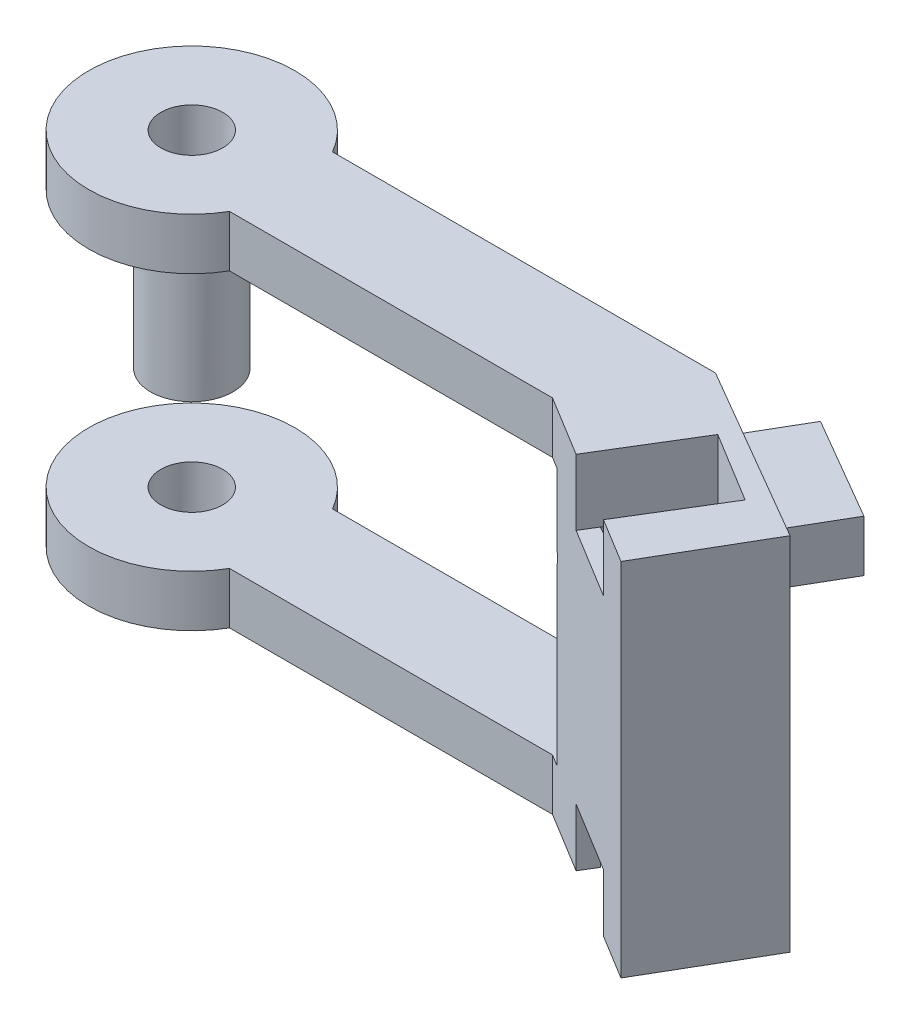
ISO-10303-21;
HEADER;
FILE_DESCRIPTION(('STEP AP214'),'2;1');
FILE_NAME('part.step','',(''),(''),'','','');
FILE_SCHEMA(('AUTOMOTIVE_DESIGN { 1 0 10303 214 1 1 1 1 }'));
ENDSEC;
DATA;
#1=APPLICATION_CONTEXT('core data for automotive mechanical design processes');
#2=APPLICATION_PROTOCOL_DEFINITION('international standard','automotive_design',2000,#1);
#3=PRODUCT_CONTEXT('',#1,'mechanical');
#4=PRODUCT('Part','Part','',(#3));
#5=PRODUCT_RELATED_PRODUCT_CATEGORY('part','',(#4));
#6=PRODUCT_DEFINITION_FORMATION('','',#4);
#7=PRODUCT_DEFINITION_CONTEXT('part definition',#1,'design');
#8=PRODUCT_DEFINITION('design','',#6,#7);
#9=PRODUCT_DEFINITION_SHAPE('','',#8);
#10=(LENGTH_UNIT() NAMED_UNIT(*) SI_UNIT(.MILLI.,.METRE.));
#11=(NAMED_UNIT(*) PLANE_ANGLE_UNIT() SI_UNIT($,.RADIAN.));
#12=(NAMED_UNIT(*) SI_UNIT($,.STERADIAN.) SOLID_ANGLE_UNIT());
#13=UNCERTAINTY_MEASURE_WITH_UNIT(LENGTH_MEASURE(1.E-05),#10,'distance_accuracy_value','');
#14=(GEOMETRIC_REPRESENTATION_CONTEXT(3) GLOBAL_UNCERTAINTY_ASSIGNED_CONTEXT((#13)) GLOBAL_UNIT_ASSIGNED_CONTEXT((#10,
#11,#12)) REPRESENTATION_CONTEXT('',''));
#15=CARTESIAN_POINT('',(0.,0.,0.));
#16=DIRECTION('',(0.,0.,1.));
#17=DIRECTION('',(1.,0.,0.));
#18=AXIS2_PLACEMENT_3D('',#15,#16,#17);
#19=CARTESIAN_POINT('',(-20.,35.,-5.));
#20=DIRECTION('',(0.,0.,1.));
#21=DIRECTION('',(1.,0.,0.));
#22=AXIS2_PLACEMENT_3D('',#19,#20,#21);
#23=PLANE('',#22);
#24=DIRECTION('',(0.,-1.,0.));
#25=VECTOR('',#24,1.);
#26=CARTESIAN_POINT('',(25.8151693115444,35.,-5.00000000000001));
#27=LINE('',#26,#25);
#28=CARTESIAN_POINT('',(25.8151693115444,70.,-5.00000000000001));
#29=VERTEX_POINT('',#28);
#30=CARTESIAN_POINT('',(25.8151693115444,35.,-5.00000000000001));
#31=VERTEX_POINT('',#30);
#32=EDGE_CURVE('E255',#29,#31,#27,.T.);
#33=ORIENTED_EDGE('',*,*,#32,.T.);
#34=DIRECTION('',(-1.,0.,0.));
#35=VECTOR('',#34,1.);
#36=CARTESIAN_POINT('',(-20.,35.,-5.));
#37=LINE('',#36,#35);
#38=CARTESIAN_POINT('',(-11.3397459621556,35.,-5.));
#39=VERTEX_POINT('',#38);
#40=EDGE_CURVE('E245',#31,#39,#37,.T.);
#41=ORIENTED_EDGE('',*,*,#40,.T.);
#42=DIRECTION('',(0.,1.,0.));
#43=VECTOR('',#42,1.);
#44=CARTESIAN_POINT('',(-11.3397459621556,30.,-5.));
#45=LINE('',#44,#43);
#46=CARTESIAN_POINT('',(-11.3397459621556,40.,-5.));
#47=VERTEX_POINT('',#46);
#48=EDGE_CURVE('E252',#39,#47,#45,.T.);
#49=ORIENTED_EDGE('',*,*,#48,.T.);
#50=DIRECTION('',(1.,0.,0.));
#51=VECTOR('',#50,1.);
#52=CARTESIAN_POINT('',(-27.1670170951595,40.,-5.));
#53=LINE('',#52,#51);
#54=CARTESIAN_POINT('',(21.0838329101293,40.,-5.00000000000001));
#55=VERTEX_POINT('',#54);
#56=EDGE_CURVE('E496',#47,#55,#53,.T.);
#57=ORIENTED_EDGE('',*,*,#56,.T.);
#58=DIRECTION('',(0.,1.,0.));
#59=VECTOR('',#58,1.);
#60=CARTESIAN_POINT('',(21.0838329101293,40.,-5.00000000000001));
#61=LINE('',#60,#59);
#62=CARTESIAN_POINT('',(21.0838329101293,65.,-5.00000000000001));
#63=VERTEX_POINT('',#62);
#64=EDGE_CURVE('E494',#55,#63,#61,.T.);
#65=ORIENTED_EDGE('',*,*,#64,.T.);
#66=DIRECTION('',(-1.,0.,0.));
#67=VECTOR('',#66,1.);
#68=CARTESIAN_POINT('',(-27.1670170951595,65.,-5.));
#69=LINE('',#68,#67);
#70=CARTESIAN_POINT('',(-11.3397459621556,65.,-5.));
#71=VERTEX_POINT('',#70);
#72=EDGE_CURVE('E373',#63,#71,#69,.T.);
#73=ORIENTED_EDGE('',*,*,#72,.T.);
#74=DIRECTION('',(0.,1.,0.));
#75=VECTOR('',#74,1.);
#76=CARTESIAN_POINT('',(-11.3397459621556,65.,-5.));
#77=LINE('',#76,#75);
#78=CARTESIAN_POINT('',(-11.3397459621556,70.,-5.00000000000001));
#79=VERTEX_POINT('',#78);
#80=EDGE_CURVE('E370',#79,#71,#77,.F.);
#81=ORIENTED_EDGE('',*,*,#80,.F.);
#82=DIRECTION('',(-1.,0.,0.));
#83=VECTOR('',#82,1.);
#84=CARTESIAN_POINT('',(20.,70.,-5.00000000000001));
#85=LINE('',#84,#83);
#86=EDGE_CURVE('E328',#29,#79,#85,.T.);
#87=ORIENTED_EDGE('',*,*,#86,.F.);
#88=EDGE_LOOP('',(#33,#41,#49,#57,#65,#73,#81,#87));
#89=FACE_BOUND('',#88,.T.);
#90=ADVANCED_FACE('F37',(#89),#23,.F.);
#91=CARTESIAN_POINT('',(-20.,35.,5.));
#92=DIRECTION('',(0.,0.,-1.));
#93=DIRECTION('',(-1.,0.,0.));
#94=AXIS2_PLACEMENT_3D('',#91,#92,#93);
#95=PLANE('',#94);
#96=DIRECTION('',(0.,1.,0.));
#97=VECTOR('',#96,1.);
#98=CARTESIAN_POINT('',(-11.3397459621556,65.,5.));
#99=LINE('',#98,#97);
#100=CARTESIAN_POINT('',(-11.3397459621556,65.,5.));
#101=VERTEX_POINT('',#100);
#102=CARTESIAN_POINT('',(-11.3397459621556,70.,5.));
#103=VERTEX_POINT('',#102);
#104=EDGE_CURVE('E376',#101,#103,#99,.T.);
#105=ORIENTED_EDGE('',*,*,#104,.F.);
#106=DIRECTION('',(-1.,0.,0.));
#107=VECTOR('',#106,1.);
#108=CARTESIAN_POINT('',(-20.,65.,5.));
#109=LINE('',#108,#107);
#110=CARTESIAN_POINT('',(20.,65.,4.99999999999999));
#111=VERTEX_POINT('',#110);
#112=EDGE_CURVE('E502',#111,#101,#109,.T.);
#113=ORIENTED_EDGE('',*,*,#112,.F.);
#114=DIRECTION('',(0.,-1.,0.));
#115=VECTOR('',#114,1.);
#116=CARTESIAN_POINT('',(20.,35.,4.99999999999999));
#117=LINE('',#116,#115);
#118=CARTESIAN_POINT('',(20.,70.,4.99999999999999));
#119=VERTEX_POINT('',#118);
#120=EDGE_CURVE('E296',#119,#111,#117,.T.);
#121=ORIENTED_EDGE('',*,*,#120,.F.);
#122=DIRECTION('',(1.,0.,0.));
#123=VECTOR('',#122,1.);
#124=CARTESIAN_POINT('',(-20.,70.,5.));
#125=LINE('',#124,#123);
#126=EDGE_CURVE('E263',#103,#119,#125,.T.);
#127=ORIENTED_EDGE('',*,*,#126,.F.);
#128=EDGE_LOOP('',(#105,#113,#121,#127));
#129=FACE_BOUND('',#128,.T.);
#130=ADVANCED_FACE('F548',(#129),#95,.F.);
#131=CARTESIAN_POINT('',(-20.,0.,0.));
#132=DIRECTION('',(0.,1.,0.));
#133=DIRECTION('',(0.,0.,1.));
#134=AXIS2_PLACEMENT_3D('',#131,#132,#133);
#135=CYLINDRICAL_SURFACE('',#134,3.);
#136=CARTESIAN_POINT('',(-20.,50.,0.));
#137=DIRECTION('',(0.,1.,0.));
#138=DIRECTION('',(-1.,0.,0.));
#139=AXIS2_PLACEMENT_3D('',#136,#137,#138);
#140=CIRCLE('',#139,3.);
#141=CARTESIAN_POINT('',(-23.,50.,0.));
#142=VERTEX_POINT('',#141);
#143=EDGE_CURVE('E463',#142,#142,#140,.F.);
#144=ORIENTED_EDGE('',*,*,#143,.T.);
#145=EDGE_LOOP('',(#144));
#146=FACE_BOUND('',#145,.T.);
#147=CARTESIAN_POINT('',(-20.,70.,0.));
#148=DIRECTION('',(0.,1.,0.));
#149=DIRECTION('',(0.,0.,1.));
#150=AXIS2_PLACEMENT_3D('',#147,#148,#149);
#151=CIRCLE('',#150,3.);
#152=CARTESIAN_POINT('',(-20.,70.,3.));
#153=VERTEX_POINT('',#152);
#154=EDGE_CURVE('E538',#153,#153,#151,.T.);
#155=ORIENTED_EDGE('',*,*,#154,.T.);
#156=EDGE_LOOP('',(#155));
#157=FACE_BOUND('',#156,.T.);
#158=ADVANCED_FACE('F571',(#146,#157),#135,.F.);
#159=DIRECTION('',(0.,1.,0.));
#160=VECTOR('',#159,1.);
#161=CARTESIAN_POINT('',(-11.3397459621556,30.,5.));
#162=LINE('',#161,#160);
#163=CARTESIAN_POINT('',(-11.3397459621556,40.,5.));
#164=VERTEX_POINT('',#163);
#165=CARTESIAN_POINT('',(-11.3397459621556,35.,5.));
#166=VERTEX_POINT('',#165);
#167=EDGE_CURVE('E262',#164,#166,#162,.F.);
#168=ORIENTED_EDGE('',*,*,#167,.T.);
#169=DIRECTION('',(1.,0.,0.));
#170=VECTOR('',#169,1.);
#171=CARTESIAN_POINT('',(-20.,35.,5.));
#172=LINE('',#171,#170);
#173=CARTESIAN_POINT('',(20.,35.,4.99999999999999));
#174=VERTEX_POINT('',#173);
#175=EDGE_CURVE('E59',#166,#174,#172,.T.);
#176=ORIENTED_EDGE('',*,*,#175,.T.);
#177=CARTESIAN_POINT('',(20.,40.,4.99999999999999));
#178=VERTEX_POINT('',#177);
#179=EDGE_CURVE('E295',#178,#174,#117,.T.);
#180=ORIENTED_EDGE('',*,*,#179,.F.);
#181=DIRECTION('',(1.,0.,0.));
#182=VECTOR('',#181,1.);
#183=CARTESIAN_POINT('',(-20.,40.,5.));
#184=LINE('',#183,#182);
#185=EDGE_CURVE('E329',#164,#178,#184,.T.);
#186=ORIENTED_EDGE('',*,*,#185,.F.);
#187=EDGE_LOOP('',(#168,#176,#180,#186));
#188=FACE_BOUND('',#187,.T.);
#189=ADVANCED_FACE('F39',(#188),#95,.F.);
#190=CARTESIAN_POINT('',(25.4009398541464,40.6,6.32701353081305));
#191=DIRECTION('',(0.,1.,0.));
#192=DIRECTION('',(0.,0.,1.));
#193=AXIS2_PLACEMENT_3D('',#190,#191,#192);
#194=PLANE('',#193);
#195=DIRECTION('',(0.864461513763628,0.,0.502699006584951));
#196=VECTOR('',#195,1.);
#197=CARTESIAN_POINT('',(25.4009398541464,40.6,6.32701353081305));
#198=LINE('',#197,#196);
#199=CARTESIAN_POINT('',(25.4009398541464,40.6,6.32701353081305));
#200=VERTEX_POINT('',#199);
#201=CARTESIAN_POINT('',(25.5306090812109,40.6,6.40241838180079));
#202=VERTEX_POINT('',#201);
#203=EDGE_CURVE('E470',#200,#202,#198,.T.);
#204=ORIENTED_EDGE('',*,*,#203,.T.);
#205=DIRECTION('',(0.50269900658495,0.,-0.864461513763629));
#206=VECTOR('',#205,1.);
#207=CARTESIAN_POINT('',(25.5306090812109,40.6,6.40241838180079));
#208=LINE('',#207,#206);
#209=CARTESIAN_POINT('',(30.5575991470604,40.6,-2.24219675583549));
#210=VERTEX_POINT('',#209);
#211=EDGE_CURVE('E389',#202,#210,#208,.T.);
#212=ORIENTED_EDGE('',*,*,#211,.T.);
#213=DIRECTION('',(0.864461513763628,0.,0.502699006584951));
#214=VECTOR('',#213,1.);
#215=CARTESIAN_POINT('',(30.4279299199959,40.6,-2.31760160682324));
#216=LINE('',#215,#214);
#217=CARTESIAN_POINT('',(30.4279299199959,40.6,-2.31760160682324));
#218=VERTEX_POINT('',#217);
#219=EDGE_CURVE('E469',#218,#210,#216,.T.);
#220=ORIENTED_EDGE('',*,*,#219,.F.);
#221=DIRECTION('',(0.50269900658495,0.,-0.864461513763628));
#222=VECTOR('',#221,1.);
#223=CARTESIAN_POINT('',(25.4009398541464,40.6,6.32701353081305));
#224=LINE('',#223,#222);
#225=EDGE_CURVE('E480',#200,#218,#224,.T.);
#226=ORIENTED_EDGE('',*,*,#225,.F.);
#227=EDGE_LOOP('',(#204,#212,#220,#226));
#228=FACE_BOUND('',#227,.T.);
#229=ADVANCED_FACE('F579',(#228),#194,.T.);
#230=CARTESIAN_POINT('',(25.8151693115444,35.,-5.00000000000001));
#231=DIRECTION('',(-0.50269900658495,0.,0.864461513763628));
#232=DIRECTION('',(0.864461513763629,0.,0.502699006584951));
#233=AXIS2_PLACEMENT_3D('',#230,#231,#232);
#234=PLANE('',#233);
#235=DIRECTION('',(0.,-1.,0.));
#236=VECTOR('',#235,1.);
#237=CARTESIAN_POINT('',(43.104399586817,35.,5.05398013169901));
#238=LINE('',#237,#236);
#239=CARTESIAN_POINT('',(43.104399586817,70.,5.05398013169901));
#240=VERTEX_POINT('',#239);
#241=CARTESIAN_POINT('',(43.104399586817,35.,5.05398013169901));
#242=VERTEX_POINT('',#241);
#243=EDGE_CURVE('E289',#240,#242,#238,.T.);
#244=ORIENTED_EDGE('',*,*,#243,.T.);
#245=DIRECTION('',(-0.864461513763629,0.,-0.502699006584951));
#246=VECTOR('',#245,1.);
#247=CARTESIAN_POINT('',(25.8151693115444,35.,-5.00000000000001));
#248=LINE('',#247,#246);
#249=CARTESIAN_POINT('',(40.943245802408,35.,3.79723261523664));
#250=VERTEX_POINT('',#249);
#251=EDGE_CURVE('E523',#242,#250,#248,.T.);
#252=ORIENTED_EDGE('',*,*,#251,.T.);
#253=DIRECTION('',(0.,1.,0.));
#254=VECTOR('',#253,1.);
#255=CARTESIAN_POINT('',(40.943245802408,35.,3.79723261523664));
#256=LINE('',#255,#254);
#257=CARTESIAN_POINT('',(40.943245802408,63.6,3.79723261523664));
#258=VERTEX_POINT('',#257);
#259=EDGE_CURVE('E280',#250,#258,#256,.T.);
#260=ORIENTED_EDGE('',*,*,#259,.T.);
#261=DIRECTION('',(0.864461513763629,0.,0.502699006584951));
#262=VECTOR('',#261,1.);
#263=CARTESIAN_POINT('',(25.8151693115444,63.6,-5.00000000000001));
#264=LINE('',#263,#262);
#265=CARTESIAN_POINT('',(40.6285757824067,63.6,3.61424667087918));
#266=VERTEX_POINT('',#265);
#267=EDGE_CURVE('E386',#266,#258,#264,.T.);
#268=ORIENTED_EDGE('',*,*,#267,.F.);
#269=DIRECTION('',(0.,1.,0.));
#270=VECTOR('',#269,1.);
#271=CARTESIAN_POINT('',(40.6285757824067,63.6,3.61424667087918));
#272=LINE('',#271,#270);
#273=CARTESIAN_POINT('',(40.6285757824067,68.6,3.61424667087918));
#274=VERTEX_POINT('',#273);
#275=EDGE_CURVE('E430',#266,#274,#272,.T.);
#276=ORIENTED_EDGE('',*,*,#275,.T.);
#277=DIRECTION('',(-0.864461513763628,0.,-0.50269900658495));
#278=VECTOR('',#277,1.);
#279=CARTESIAN_POINT('',(40.6285757824067,68.6,3.61424667087918));
#280=LINE('',#279,#278);
#281=CARTESIAN_POINT('',(30.5575991470604,68.6,-2.24219675583549));
#282=VERTEX_POINT('',#281);
#283=EDGE_CURVE('E437',#274,#282,#280,.T.);
#284=ORIENTED_EDGE('',*,*,#283,.T.);
#285=DIRECTION('',(0.,-1.,0.));
#286=VECTOR('',#285,1.);
#287=CARTESIAN_POINT('',(30.5575991470604,63.6,-2.24219675583549));
#288=LINE('',#287,#286);
#289=CARTESIAN_POINT('',(30.5575991470604,63.6,-2.24219675583549));
#290=VERTEX_POINT('',#289);
#291=EDGE_CURVE('E448',#282,#290,#288,.T.);
#292=ORIENTED_EDGE('',*,*,#291,.T.);
#293=DIRECTION('',(-0.864461513763628,0.,-0.50269900658495));
#294=VECTOR('',#293,1.);
#295=CARTESIAN_POINT('',(30.4279299199959,63.6,-2.31760160682324));
#296=LINE('',#295,#294);
#297=CARTESIAN_POINT('',(30.4279299199959,63.6,-2.31760160682324));
#298=VERTEX_POINT('',#297);
#299=EDGE_CURVE('E487',#290,#298,#296,.T.);
#300=ORIENTED_EDGE('',*,*,#299,.T.);
#301=DIRECTION('',(0.,-1.,0.));
#302=VECTOR('',#301,1.);
#303=CARTESIAN_POINT('',(30.4279299199959,40.6,-2.31760160682324));
#304=LINE('',#303,#302);
#305=EDGE_CURVE('E484',#298,#218,#304,.T.);
#306=ORIENTED_EDGE('',*,*,#305,.T.);
#307=ORIENTED_EDGE('',*,*,#219,.T.);
#308=DIRECTION('',(0.,1.,0.));
#309=VECTOR('',#308,1.);
#310=CARTESIAN_POINT('',(30.5575991470604,29.4,-2.24219675583549));
#311=LINE('',#310,#309);
#312=CARTESIAN_POINT('',(30.5575991470604,35.,-2.24219675583549));
#313=VERTEX_POINT('',#312);
#314=EDGE_CURVE('E285',#313,#210,#311,.T.);
#315=ORIENTED_EDGE('',*,*,#314,.F.);
#316=EDGE_CURVE('E520',#313,#31,#248,.T.);
#317=ORIENTED_EDGE('',*,*,#316,.T.);
#318=ORIENTED_EDGE('',*,*,#32,.F.);
#319=DIRECTION('',(-0.864461513763628,0.,-0.502699006584951));
#320=VECTOR('',#319,1.);
#321=CARTESIAN_POINT('',(25.8151693115444,70.,-5.00000000000001));
#322=LINE('',#321,#320);
#323=EDGE_CURVE('E335',#240,#29,#322,.T.);
#324=ORIENTED_EDGE('',*,*,#323,.F.);
#325=EDGE_LOOP('',(#244,#252,#260,#268,#276,#284,#292,#300,#306,#307,#315,#317,#318,#324));
#326=FACE_BOUND('',#325,.T.);
#327=ADVANCED_FACE('F364',(#326),#234,.F.);
#328=CARTESIAN_POINT('',(25.8822809888346,11.8971644156994,8.59291472879151));
#329=DIRECTION('',(-0.85339881586406,0.,-0.52125853574001));
#330=DIRECTION('',(-0.52125853574001,0.,0.85339881586406));
#331=AXIS2_PLACEMENT_3D('',#328,#329,#330);
#332=PLANE('',#331);
#333=DIRECTION('',(0.,1.,0.));
#334=VECTOR('',#333,1.);
#335=CARTESIAN_POINT('',(25.8822809888346,11.8971644156994,8.59291472879151));
#336=LINE('',#335,#334);
#337=CARTESIAN_POINT('',(25.8822809888346,35.,8.59291472879151));
#338=VERTEX_POINT('',#337);
#339=CARTESIAN_POINT('',(25.8822809888346,40.6,8.59291472879151));
#340=VERTEX_POINT('',#339);
#341=EDGE_CURVE('E283',#338,#340,#336,.T.);
#342=ORIENTED_EDGE('',*,*,#341,.F.);
#343=DIRECTION('',(0.52125853574001,0.,-0.85339881586406));
#344=VECTOR('',#343,1.);
#345=CARTESIAN_POINT('',(25.8822809888346,35.,8.59291472879151));
#346=LINE('',#345,#344);
#347=CARTESIAN_POINT('',(26.7773942266134,35.,7.12744505336418));
#348=VERTEX_POINT('',#347);
#349=EDGE_CURVE('E517',#338,#348,#346,.T.);
#350=ORIENTED_EDGE('',*,*,#349,.T.);
#351=DIRECTION('',(0.,-1.,0.));
#352=VECTOR('',#351,1.);
#353=CARTESIAN_POINT('',(26.7773942266134,11.8971644156994,7.12744505336418));
#354=LINE('',#353,#352);
#355=CARTESIAN_POINT('',(26.7773942266134,40.6,7.12744505336418));
#356=VERTEX_POINT('',#355);
#357=EDGE_CURVE('E277',#356,#348,#354,.T.);
#358=ORIENTED_EDGE('',*,*,#357,.F.);
#359=DIRECTION('',(0.52125853574001,0.,-0.85339881586406));
#360=VECTOR('',#359,1.);
#361=CARTESIAN_POINT('',(25.8822809888346,40.6,8.59291472879151));
#362=LINE('',#361,#360);
#363=EDGE_CURVE('E406',#340,#356,#362,.T.);
#364=ORIENTED_EDGE('',*,*,#363,.F.);
#365=EDGE_LOOP('',(#342,#350,#358,#364));
#366=FACE_BOUND('',#365,.T.);
#367=ADVANCED_FACE('F578',(#366),#332,.F.);
#368=CARTESIAN_POINT('',(37.9220568731472,11.8971644156994,4.228994856071));
#369=DIRECTION('',(0.85339881586406,0.,0.521258535740011));
#370=DIRECTION('',(0.521258535740011,0.,-0.85339881586406));
#371=AXIS2_PLACEMENT_3D('',#368,#369,#370);
#372=PLANE('',#371);
#373=DIRECTION('',(0.,1.,0.));
#374=VECTOR('',#373,1.);
#375=CARTESIAN_POINT('',(33.694700972413,11.8971644156994,11.1499760440355));
#376=LINE('',#375,#374);
#377=CARTESIAN_POINT('',(33.694700972413,35.,11.1499760440355));
#378=VERTEX_POINT('',#377);
#379=CARTESIAN_POINT('',(33.694700972413,40.6,11.1499760440355));
#380=VERTEX_POINT('',#379);
#381=EDGE_CURVE('E275',#378,#380,#376,.T.);
#382=ORIENTED_EDGE('',*,*,#381,.F.);
#383=DIRECTION('',(-0.521258535740011,0.,0.85339881586406));
#384=VECTOR('',#383,1.);
#385=CARTESIAN_POINT('',(37.9220568731472,35.,4.228994856071));
#386=LINE('',#385,#384);
#387=CARTESIAN_POINT('',(32.7094715157471,35.,12.7629830147116));
#388=VERTEX_POINT('',#387);
#389=EDGE_CURVE('E531',#378,#388,#386,.T.);
#390=ORIENTED_EDGE('',*,*,#389,.T.);
#391=DIRECTION('',(0.,1.,0.));
#392=VECTOR('',#391,1.);
#393=CARTESIAN_POINT('',(32.7094715157471,11.8971644156994,12.7629830147116));
#394=LINE('',#393,#392);
#395=CARTESIAN_POINT('',(32.7094715157471,40.6,12.7629830147116));
#396=VERTEX_POINT('',#395);
#397=EDGE_CURVE('E282',#388,#396,#394,.T.);
#398=ORIENTED_EDGE('',*,*,#397,.T.);
#399=DIRECTION('',(-0.521258535740011,0.,0.85339881586406));
#400=VECTOR('',#399,1.);
#401=CARTESIAN_POINT('',(37.9220568731472,40.6,4.228994856071));
#402=LINE('',#401,#400);
#403=EDGE_CURVE('E424',#380,#396,#402,.T.);
#404=ORIENTED_EDGE('',*,*,#403,.F.);
#405=EDGE_LOOP('',(#382,#390,#398,#404));
#406=FACE_BOUND('',#405,.T.);
#407=ADVANCED_FACE('F590',(#406),#372,.F.);
#408=CARTESIAN_POINT('',(21.0838329101293,40.,25.));
#409=DIRECTION('',(-1.,0.,0.));
#410=DIRECTION('',(0.,0.,1.));
#411=AXIS2_PLACEMENT_3D('',#408,#409,#410);
#412=PLANE('',#411);
#413=DIRECTION('',(0.,-1.,0.));
#414=VECTOR('',#413,1.);
#415=CARTESIAN_POINT('',(21.0838329101293,40.,4.99999999999999));
#416=LINE('',#415,#414);
#417=CARTESIAN_POINT('',(21.0838329101293,58.1618485481595,4.99999999999999));
#418=VERTEX_POINT('',#417);
#419=CARTESIAN_POINT('',(21.0838329101293,56.8381514518405,4.99999999999999));
#420=VERTEX_POINT('',#419);
#421=EDGE_CURVE('E302',#418,#420,#416,.T.);
#422=ORIENTED_EDGE('',*,*,#421,.F.);
#423=DIRECTION('',(0.,0.,-1.));
#424=VECTOR('',#423,1.);
#425=CARTESIAN_POINT('',(21.0838329101293,58.1618485481595,105.));
#426=LINE('',#425,#424);
#427=CARTESIAN_POINT('',(21.0838329101293,58.1618485481595,5.66200836609879));
#428=VERTEX_POINT('',#427);
#429=EDGE_CURVE('E45',#418,#428,#426,.F.);
#430=ORIENTED_EDGE('',*,*,#429,.T.);
#431=DIRECTION('',(0.,1.,0.));
#432=VECTOR('',#431,1.);
#433=CARTESIAN_POINT('',(21.0838329101293,35.,5.66200836609879));
#434=LINE('',#433,#432);
#435=CARTESIAN_POINT('',(21.0838329101293,65.,5.66200836609879));
#436=VERTEX_POINT('',#435);
#437=EDGE_CURVE('E312',#428,#436,#434,.T.);
#438=ORIENTED_EDGE('',*,*,#437,.T.);
#439=DIRECTION('',(0.,0.,-1.));
#440=VECTOR('',#439,1.);
#441=CARTESIAN_POINT('',(21.0838329101293,65.,25.));
#442=LINE('',#441,#440);
#443=EDGE_CURVE('E498',#436,#63,#442,.T.);
#444=ORIENTED_EDGE('',*,*,#443,.T.);
#445=ORIENTED_EDGE('',*,*,#64,.F.);
#446=DIRECTION('',(0.,0.,-1.));
#447=VECTOR('',#446,1.);
#448=CARTESIAN_POINT('',(21.0838329101293,40.,25.));
#449=LINE('',#448,#447);
#450=CARTESIAN_POINT('',(21.0838329101293,40.,5.66200836609879));
#451=VERTEX_POINT('',#450);
#452=EDGE_CURVE('E499',#451,#55,#449,.T.);
#453=ORIENTED_EDGE('',*,*,#452,.F.);
#454=CARTESIAN_POINT('',(21.0838329101293,56.8381514518405,5.66200836609879));
#455=VERTEX_POINT('',#454);
#456=EDGE_CURVE('E325',#451,#455,#434,.T.);
#457=ORIENTED_EDGE('',*,*,#456,.T.);
#458=DIRECTION('',(0.,0.,-1.));
#459=VECTOR('',#458,1.);
#460=CARTESIAN_POINT('',(21.0838329101293,56.8381514518405,105.));
#461=LINE('',#460,#459);
#462=EDGE_CURVE('E304',#455,#420,#461,.T.);
#463=ORIENTED_EDGE('',*,*,#462,.T.);
#464=EDGE_LOOP('',(#422,#430,#438,#444,#445,#453,#457,#463));
#465=FACE_BOUND('',#464,.T.);
#466=ADVANCED_FACE('F311',(#465),#412,.T.);
#467=CARTESIAN_POINT('',(20.,35.,4.99999999999999));
#468=DIRECTION('',(0.52125853574001,0.,-0.85339881586406));
#469=DIRECTION('',(-0.85339881586406,0.,-0.52125853574001));
#470=AXIS2_PLACEMENT_3D('',#467,#468,#469);
#471=PLANE('',#470);
#472=ORIENTED_EDGE('',*,*,#179,.T.);
#473=DIRECTION('',(0.85339881586406,0.,0.52125853574001));
#474=VECTOR('',#473,1.);
#475=CARTESIAN_POINT('',(20.,35.,4.99999999999999));
#476=LINE('',#475,#474);
#477=EDGE_CURVE('E256',#174,#338,#476,.T.);
#478=ORIENTED_EDGE('',*,*,#477,.T.);
#479=ORIENTED_EDGE('',*,*,#341,.T.);
#480=DIRECTION('',(-0.853398815864061,0.,-0.52125853574001));
#481=VECTOR('',#480,1.);
#482=CARTESIAN_POINT('',(32.7094715157471,40.6,12.7629830147116));
#483=LINE('',#482,#481);
#484=EDGE_CURVE('E427',#396,#340,#483,.T.);
#485=ORIENTED_EDGE('',*,*,#484,.F.);
#486=ORIENTED_EDGE('',*,*,#397,.F.);
#487=CARTESIAN_POINT('',(37.0679763172812,35.,15.4251707148002));
#488=VERTEX_POINT('',#487);
#489=EDGE_CURVE('E356',#388,#488,#476,.T.);
#490=ORIENTED_EDGE('',*,*,#489,.T.);
#491=DIRECTION('',(0.,-1.,0.));
#492=VECTOR('',#491,1.);
#493=CARTESIAN_POINT('',(37.0679763172812,35.,15.4251707148002));
#494=LINE('',#493,#492);
#495=CARTESIAN_POINT('',(37.0679763172812,70.,15.4251707148002));
#496=VERTEX_POINT('',#495);
#497=EDGE_CURVE('E292',#496,#488,#494,.T.);
#498=ORIENTED_EDGE('',*,*,#497,.F.);
#499=DIRECTION('',(0.85339881586406,0.,0.52125853574001));
#500=VECTOR('',#499,1.);
#501=CARTESIAN_POINT('',(20.,70.,4.99999999999999));
#502=LINE('',#501,#500);
#503=CARTESIAN_POINT('',(32.7094715157471,70.,12.7629830147116));
#504=VERTEX_POINT('',#503);
#505=EDGE_CURVE('E340',#504,#496,#502,.T.);
#506=ORIENTED_EDGE('',*,*,#505,.F.);
#507=DIRECTION('',(0.,1.,0.));
#508=VECTOR('',#507,1.);
#509=CARTESIAN_POINT('',(32.7094715157471,-11.1028355843006,12.7629830147116));
#510=LINE('',#509,#508);
#511=CARTESIAN_POINT('',(32.7094715157471,63.6,12.7629830147116));
#512=VERTEX_POINT('',#511);
#513=EDGE_CURVE('E412',#512,#504,#510,.T.);
#514=ORIENTED_EDGE('',*,*,#513,.F.);
#515=DIRECTION('',(0.85339881586406,0.,0.52125853574001));
#516=VECTOR('',#515,1.);
#517=CARTESIAN_POINT('',(25.8822809888346,63.6,8.59291472879151));
#518=LINE('',#517,#516);
#519=CARTESIAN_POINT('',(25.8822809888346,63.6,8.59291472879151));
#520=VERTEX_POINT('',#519);
#521=EDGE_CURVE('E403',#520,#512,#518,.T.);
#522=ORIENTED_EDGE('',*,*,#521,.F.);
#523=DIRECTION('',(0.,1.,0.));
#524=VECTOR('',#523,1.);
#525=CARTESIAN_POINT('',(25.8822809888346,-11.1028355843006,8.59291472879151));
#526=LINE('',#525,#524);
#527=CARTESIAN_POINT('',(25.8822809888346,70.,8.59291472879151));
#528=VERTEX_POINT('',#527);
#529=EDGE_CURVE('E413',#520,#528,#526,.T.);
#530=ORIENTED_EDGE('',*,*,#529,.T.);
#531=EDGE_CURVE('E267',#119,#528,#502,.T.);
#532=ORIENTED_EDGE('',*,*,#531,.F.);
#533=ORIENTED_EDGE('',*,*,#120,.T.);
#534=DIRECTION('',(-0.85339881586406,0.,-0.52125853574001));
#535=VECTOR('',#534,1.);
#536=CARTESIAN_POINT('',(20.,65.,4.99999999999999));
#537=LINE('',#536,#535);
#538=EDGE_CURVE('E324',#436,#111,#537,.T.);
#539=ORIENTED_EDGE('',*,*,#538,.F.);
#540=ORIENTED_EDGE('',*,*,#437,.F.);
#541=CARTESIAN_POINT('',(20.0187167196133,57.5,5.01143222802532));
#542=DIRECTION('',(0.52125853574001,0.,-0.85339881586406));
#543=DIRECTION('',(-0.85339881586406,0.,-0.52125853574001));
#544=AXIS2_PLACEMENT_3D('',#541,#542,#543);
#545=ELLIPSE('',#544,1.46941849073265,1.254);
#546=EDGE_CURVE('E322',#455,#428,#545,.F.);
#547=ORIENTED_EDGE('',*,*,#546,.F.);
#548=ORIENTED_EDGE('',*,*,#456,.F.);
#549=DIRECTION('',(0.85339881586406,0.,0.52125853574001));
#550=VECTOR('',#549,1.);
#551=CARTESIAN_POINT('',(20.,40.,4.99999999999999));
#552=LINE('',#551,#550);
#553=EDGE_CURVE('E326',#178,#451,#552,.T.);
#554=ORIENTED_EDGE('',*,*,#553,.F.);
#555=EDGE_LOOP('',(#472,#478,#479,#485,#486,#490,#498,#506,#514,#522,#530,#532,#533,#539,#540,
#547,#548,#554));
#556=FACE_BOUND('',#555,.T.);
#557=ADVANCED_FACE('F320',(#556),#471,.F.);
#558=CARTESIAN_POINT('',(-20.,70.,0.));
#559=DIRECTION('',(0.,-1.,0.));
#560=DIRECTION('',(0.,0.,1.));
#561=AXIS2_PLACEMENT_3D('',#558,#559,#560);
#562=PLANE('',#561);
#563=ORIENTED_EDGE('',*,*,#154,.F.);
#564=EDGE_LOOP('',(#563));
#565=FACE_BOUND('',#564,.T.);
#566=ORIENTED_EDGE('',*,*,#86,.T.);
#567=CARTESIAN_POINT('',(-20.,70.,0.));
#568=DIRECTION('',(0.,-1.,0.));
#569=DIRECTION('',(0.,0.,-1.));
#570=AXIS2_PLACEMENT_3D('',#567,#568,#569);
#571=CIRCLE('',#570,10.);
#572=EDGE_CURVE('E366',#103,#79,#571,.T.);
#573=ORIENTED_EDGE('',*,*,#572,.F.);
#574=ORIENTED_EDGE('',*,*,#126,.T.);
#575=ORIENTED_EDGE('',*,*,#531,.T.);
#576=DIRECTION('',(0.52125853574001,0.,-0.85339881586406));
#577=VECTOR('',#576,1.);
#578=CARTESIAN_POINT('',(31.0948663462347,70.,0.0589265701509082));
#579=LINE('',#578,#577);
#580=CARTESIAN_POINT('',(31.0948663462347,70.,0.0589265701509099));
#581=VERTEX_POINT('',#580);
#582=EDGE_CURVE('E410',#528,#581,#579,.T.);
#583=ORIENTED_EDGE('',*,*,#582,.T.);
#584=DIRECTION('',(0.85339881586406,0.,0.521258535740011));
#585=VECTOR('',#584,1.);
#586=CARTESIAN_POINT('',(37.9220568731472,70.,4.22899485607099));
#587=LINE('',#586,#585);
#588=CARTESIAN_POINT('',(37.9220568731472,70.,4.22899485607099));
#589=VERTEX_POINT('',#588);
#590=EDGE_CURVE('E408',#581,#589,#587,.T.);
#591=ORIENTED_EDGE('',*,*,#590,.T.);
#592=DIRECTION('',(-0.52125853574001,0.,0.853398815864061));
#593=VECTOR('',#592,1.);
#594=CARTESIAN_POINT('',(32.7094715157471,70.,12.7629830147116));
#595=LINE('',#594,#593);
#596=EDGE_CURVE('E352',#589,#504,#595,.T.);
#597=ORIENTED_EDGE('',*,*,#596,.T.);
#598=ORIENTED_EDGE('',*,*,#505,.T.);
#599=DIRECTION('',(0.503035272461317,0.,-0.864265881925099));
#600=VECTOR('',#599,1.);
#601=CARTESIAN_POINT('',(43.104399586817,70.,5.05398013169901));
#602=LINE('',#601,#600);
#603=EDGE_CURVE('E338',#496,#240,#602,.T.);
#604=ORIENTED_EDGE('',*,*,#603,.T.);
#605=ORIENTED_EDGE('',*,*,#323,.T.);
#606=EDGE_LOOP('',(#566,#573,#574,#575,#583,#591,#597,#598,#604,#605));
#607=FACE_BOUND('',#606,.T.);
#608=ADVANCED_FACE('F348',(#565,#607),#562,.F.);
#609=CARTESIAN_POINT('',(25.4009398541464,63.6,6.32701353081305));
#610=DIRECTION('',(0.,-1.,0.));
#611=DIRECTION('',(1.,0.,0.));
#612=AXIS2_PLACEMENT_3D('',#609,#610,#611);
#613=PLANE('',#612);
#614=DIRECTION('',(-0.864461513763628,0.,-0.50269900658495));
#615=VECTOR('',#614,1.);
#616=CARTESIAN_POINT('',(25.4009398541464,63.6,6.32701353081305));
#617=LINE('',#616,#615);
#618=CARTESIAN_POINT('',(26.7773942266134,63.6,7.12744505336417));
#619=VERTEX_POINT('',#618);
#620=CARTESIAN_POINT('',(25.4009398541464,63.6,6.32701353081305));
#621=VERTEX_POINT('',#620);
#622=EDGE_CURVE('E476',#619,#621,#617,.T.);
#623=ORIENTED_EDGE('',*,*,#622,.T.);
#624=DIRECTION('',(0.50269900658495,0.,-0.864461513763628));
#625=VECTOR('',#624,1.);
#626=CARTESIAN_POINT('',(25.4009398541464,63.6,6.32701353081305));
#627=LINE('',#626,#625);
#628=EDGE_CURVE('E489',#621,#298,#627,.T.);
#629=ORIENTED_EDGE('',*,*,#628,.T.);
#630=ORIENTED_EDGE('',*,*,#299,.F.);
#631=DIRECTION('',(-0.50269900658495,0.,0.864461513763628));
#632=VECTOR('',#631,1.);
#633=CARTESIAN_POINT('',(33.5737931865701,63.6,-7.42896583841726));
#634=LINE('',#633,#632);
#635=CARTESIAN_POINT('',(33.5737931865701,63.6,-7.42896583841726));
#636=VERTEX_POINT('',#635);
#637=EDGE_CURVE('E457',#636,#290,#634,.T.);
#638=ORIENTED_EDGE('',*,*,#637,.F.);
#639=DIRECTION('',(0.864461513763628,0.,0.50269900658495));
#640=VECTOR('',#639,1.);
#641=CARTESIAN_POINT('',(43.6447698219164,63.6,-1.57252241170259));
#642=LINE('',#641,#640);
#643=CARTESIAN_POINT('',(43.6447698219164,63.6,-1.57252241170259));
#644=VERTEX_POINT('',#643);
#645=EDGE_CURVE('E436',#636,#644,#642,.T.);
#646=ORIENTED_EDGE('',*,*,#645,.T.);
#647=DIRECTION('',(-0.50269900658495,0.,0.864461513763628));
#648=VECTOR('',#647,1.);
#649=CARTESIAN_POINT('',(43.6447698219164,63.6,-1.57252241170259));
#650=LINE('',#649,#648);
#651=EDGE_CURVE('E460',#644,#266,#650,.T.);
#652=ORIENTED_EDGE('',*,*,#651,.T.);
#653=ORIENTED_EDGE('',*,*,#267,.T.);
#654=DIRECTION('',(0.50269900658495,0.,-0.864461513763629));
#655=VECTOR('',#654,1.);
#656=CARTESIAN_POINT('',(35.9162557365585,63.6,12.4418477528729));
#657=LINE('',#656,#655);
#658=CARTESIAN_POINT('',(35.9162557365585,63.6,12.4418477528729));
#659=VERTEX_POINT('',#658);
#660=EDGE_CURVE('E378',#659,#258,#657,.T.);
#661=ORIENTED_EDGE('',*,*,#660,.F.);
#662=CARTESIAN_POINT('',(33.694700972413,63.6,11.1499760440355));
#663=VERTEX_POINT('',#662);
#664=EDGE_CURVE('E477',#659,#663,#617,.T.);
#665=ORIENTED_EDGE('',*,*,#664,.T.);
#666=DIRECTION('',(0.52125853574001,0.,-0.853398815864061));
#667=VECTOR('',#666,1.);
#668=CARTESIAN_POINT('',(32.7094715157471,63.6,12.7629830147116));
#669=LINE('',#668,#667);
#670=CARTESIAN_POINT('',(37.9220568731472,63.6,4.22899485607099));
#671=VERTEX_POINT('',#670);
#672=EDGE_CURVE('E416',#663,#671,#669,.T.);
#673=ORIENTED_EDGE('',*,*,#672,.T.);
#674=DIRECTION('',(-0.85339881586406,0.,-0.521258535740011));
#675=VECTOR('',#674,1.);
#676=CARTESIAN_POINT('',(37.9220568731472,63.6,4.22899485607098));
#677=LINE('',#676,#675);
#678=CARTESIAN_POINT('',(31.0948663462347,63.6,0.0589265701509065));
#679=VERTEX_POINT('',#678);
#680=EDGE_CURVE('E395',#671,#679,#677,.T.);
#681=ORIENTED_EDGE('',*,*,#680,.T.);
#682=DIRECTION('',(-0.52125853574001,0.,0.85339881586406));
#683=VECTOR('',#682,1.);
#684=CARTESIAN_POINT('',(31.0948663462347,63.6,0.0589265701509084));
#685=LINE('',#684,#683);
#686=EDGE_CURVE('E400',#679,#619,#685,.T.);
#687=ORIENTED_EDGE('',*,*,#686,.T.);
#688=EDGE_LOOP('',(#623,#629,#630,#638,#646,#652,#653,#661,#665,#673,#681,#687));
#689=FACE_BOUND('',#688,.T.);
#690=ADVANCED_FACE('F587',(#689),#613,.T.);
#691=CARTESIAN_POINT('',(-20.,35.,0.));
#692=DIRECTION('',(0.,1.,0.));
#693=DIRECTION('',(0.,0.,1.));
#694=AXIS2_PLACEMENT_3D('',#691,#692,#693);
#695=CIRCLE('',#694,3.);
#696=CARTESIAN_POINT('',(-20.,35.,3.));
#697=VERTEX_POINT('',#696);
#698=EDGE_CURVE('E535',#697,#697,#695,.F.);
#699=ORIENTED_EDGE('',*,*,#698,.T.);
#700=EDGE_LOOP('',(#699));
#701=FACE_BOUND('',#700,.T.);
#702=CARTESIAN_POINT('',(-20.,40.,0.));
#703=DIRECTION('',(0.,1.,0.));
#704=DIRECTION('',(-1.,0.,0.));
#705=AXIS2_PLACEMENT_3D('',#702,#703,#704);
#706=CIRCLE('',#705,3.);
#707=CARTESIAN_POINT('',(-23.,40.,0.));
#708=VERTEX_POINT('',#707);
#709=EDGE_CURVE('E541',#708,#708,#706,.F.);
#710=ORIENTED_EDGE('',*,*,#709,.F.);
#711=EDGE_LOOP('',(#710));
#712=FACE_BOUND('',#711,.T.);
#713=ADVANCED_FACE('F581',(#701,#712),#135,.F.);
#714=CARTESIAN_POINT('',(43.104399586817,35.,5.05398013169901));
#715=DIRECTION('',(-0.864265881925099,0.,-0.503035272461317));
#716=DIRECTION('',(-0.503035272461317,0.,0.864265881925099));
#717=AXIS2_PLACEMENT_3D('',#714,#715,#716);
#718=PLANE('',#717);
#719=ORIENTED_EDGE('',*,*,#497,.T.);
#720=DIRECTION('',(0.503035272461317,0.,-0.864265881925099));
#721=VECTOR('',#720,1.);
#722=CARTESIAN_POINT('',(43.104399586817,35.,5.05398013169901));
#723=LINE('',#722,#721);
#724=EDGE_CURVE('E361',#488,#242,#723,.T.);
#725=ORIENTED_EDGE('',*,*,#724,.T.);
#726=ORIENTED_EDGE('',*,*,#243,.F.);
#727=ORIENTED_EDGE('',*,*,#603,.F.);
#728=EDGE_LOOP('',(#719,#725,#726,#727));
#729=FACE_BOUND('',#728,.T.);
#730=ADVANCED_FACE('F359',(#729),#718,.F.);
#731=CARTESIAN_POINT('',(3.66948534912537,0.,-6.31019520246918));
#732=DIRECTION('',(-0.50269900658495,0.,0.864461513763628));
#733=DIRECTION('',(0.864461513763628,0.,0.50269900658495));
#734=AXIS2_PLACEMENT_3D('',#731,#732,#733);
#735=PLANE('',#734);
#736=DIRECTION('',(0.,-1.,0.));
#737=VECTOR('',#736,1.);
#738=CARTESIAN_POINT('',(35.9162557365585,35.0800490304433,12.4418477528729));
#739=LINE('',#738,#737);
#740=CARTESIAN_POINT('',(35.9162557365585,35.,12.4418477528729));
#741=VERTEX_POINT('',#740);
#742=EDGE_CURVE('E265',#659,#741,#739,.T.);
#743=ORIENTED_EDGE('',*,*,#742,.T.);
#744=DIRECTION('',(-0.864461513763628,0.,-0.50269900658495));
#745=VECTOR('',#744,1.);
#746=CARTESIAN_POINT('',(3.66948534912537,35.,-6.31019520246918));
#747=LINE('',#746,#745);
#748=EDGE_CURVE('E52',#741,#378,#747,.T.);
#749=ORIENTED_EDGE('',*,*,#748,.T.);
#750=ORIENTED_EDGE('',*,*,#381,.T.);
#751=EDGE_CURVE('E474',#356,#380,#198,.T.);
#752=ORIENTED_EDGE('',*,*,#751,.F.);
#753=ORIENTED_EDGE('',*,*,#357,.T.);
#754=CARTESIAN_POINT('',(25.5306090812109,35.,6.40241838180079));
#755=VERTEX_POINT('',#754);
#756=EDGE_CURVE('E526',#348,#755,#747,.T.);
#757=ORIENTED_EDGE('',*,*,#756,.T.);
#758=DIRECTION('',(0.,1.,0.));
#759=VECTOR('',#758,1.);
#760=CARTESIAN_POINT('',(25.5306090812109,35.0800490304433,6.40241838180079));
#761=LINE('',#760,#759);
#762=EDGE_CURVE('E273',#755,#202,#761,.T.);
#763=ORIENTED_EDGE('',*,*,#762,.T.);
#764=ORIENTED_EDGE('',*,*,#203,.F.);
#765=DIRECTION('',(0.,-1.,0.));
#766=VECTOR('',#765,1.);
#767=CARTESIAN_POINT('',(25.4009398541464,40.6,6.32701353081305));
#768=LINE('',#767,#766);
#769=EDGE_CURVE('E473',#621,#200,#768,.T.);
#770=ORIENTED_EDGE('',*,*,#769,.F.);
#771=ORIENTED_EDGE('',*,*,#622,.F.);
#772=EDGE_CURVE('E481',#663,#619,#617,.T.);
#773=ORIENTED_EDGE('',*,*,#772,.F.);
#774=ORIENTED_EDGE('',*,*,#664,.F.);
#775=EDGE_LOOP('',(#743,#749,#750,#752,#753,#757,#763,#764,#770,#771,#773,#774));
#776=FACE_BOUND('',#775,.T.);
#777=ADVANCED_FACE('F574',(#776),#735,.F.);
#778=CARTESIAN_POINT('',(35.9162557365585,35.0800490304433,12.4418477528729));
#779=DIRECTION('',(0.864461513763629,0.,0.50269900658495));
#780=DIRECTION('',(0.50269900658495,0.,-0.864461513763629));
#781=AXIS2_PLACEMENT_3D('',#778,#779,#780);
#782=PLANE('',#781);
#783=ORIENTED_EDGE('',*,*,#259,.F.);
#784=DIRECTION('',(-0.50269900658495,0.,0.864461513763629));
#785=VECTOR('',#784,1.);
#786=CARTESIAN_POINT('',(35.9162557365585,35.,12.4418477528729));
#787=LINE('',#786,#785);
#788=EDGE_CURVE('E529',#250,#741,#787,.T.);
#789=ORIENTED_EDGE('',*,*,#788,.T.);
#790=ORIENTED_EDGE('',*,*,#742,.F.);
#791=ORIENTED_EDGE('',*,*,#660,.T.);
#792=EDGE_LOOP('',(#783,#789,#790,#791));
#793=FACE_BOUND('',#792,.T.);
#794=ADVANCED_FACE('F610',(#793),#782,.F.);
#795=CARTESIAN_POINT('',(25.5306090812109,35.0800490304433,6.40241838180079));
#796=DIRECTION('',(-0.864461513763629,0.,-0.50269900658495));
#797=DIRECTION('',(-0.50269900658495,0.,0.864461513763629));
#798=AXIS2_PLACEMENT_3D('',#795,#796,#797);
#799=PLANE('',#798);
#800=ORIENTED_EDGE('',*,*,#762,.F.);
#801=DIRECTION('',(0.50269900658495,0.,-0.864461513763629));
#802=VECTOR('',#801,1.);
#803=CARTESIAN_POINT('',(25.5306090812109,35.,6.40241838180079));
#804=LINE('',#803,#802);
#805=EDGE_CURVE('E522',#755,#313,#804,.T.);
#806=ORIENTED_EDGE('',*,*,#805,.T.);
#807=ORIENTED_EDGE('',*,*,#314,.T.);
#808=ORIENTED_EDGE('',*,*,#211,.F.);
#809=EDGE_LOOP('',(#800,#806,#807,#808));
#810=FACE_BOUND('',#809,.T.);
#811=ADVANCED_FACE('F607',(#810),#799,.F.);
#812=CARTESIAN_POINT('',(-20.,30.,0.));
#813=DIRECTION('',(0.,1.,0.));
#814=DIRECTION('',(0.,0.,1.));
#815=AXIS2_PLACEMENT_3D('',#812,#813,#814);
#816=CYLINDRICAL_SURFACE('',#815,10.);
#817=CARTESIAN_POINT('',(-20.,35.,0.));
#818=DIRECTION('',(0.,1.,0.));
#819=DIRECTION('',(0.,0.,1.));
#820=AXIS2_PLACEMENT_3D('',#817,#818,#819);
#821=CIRCLE('',#820,10.);
#822=EDGE_CURVE('E11',#166,#39,#821,.F.);
#823=ORIENTED_EDGE('',*,*,#822,.F.);
#824=ORIENTED_EDGE('',*,*,#167,.F.);
#825=CARTESIAN_POINT('',(-20.,40.,0.));
#826=DIRECTION('',(0.,1.,0.));
#827=DIRECTION('',(0.,0.,1.));
#828=AXIS2_PLACEMENT_3D('',#825,#826,#827);
#829=CIRCLE('',#828,10.);
#830=EDGE_CURVE('E261',#47,#164,#829,.T.);
#831=ORIENTED_EDGE('',*,*,#830,.F.);
#832=ORIENTED_EDGE('',*,*,#48,.F.);
#833=EDGE_LOOP('',(#823,#824,#831,#832));
#834=FACE_BOUND('',#833,.T.);
#835=ADVANCED_FACE('F259',(#834),#816,.T.);
#836=CARTESIAN_POINT('',(-27.1670170951595,40.,25.));
#837=DIRECTION('',(0.,1.,0.));
#838=DIRECTION('',(-1.,0.,0.));
#839=AXIS2_PLACEMENT_3D('',#836,#837,#838);
#840=PLANE('',#839);
#841=ORIENTED_EDGE('',*,*,#709,.T.);
#842=EDGE_LOOP('',(#841));
#843=FACE_BOUND('',#842,.T.);
#844=ORIENTED_EDGE('',*,*,#830,.T.);
#845=ORIENTED_EDGE('',*,*,#185,.T.);
#846=ORIENTED_EDGE('',*,*,#553,.T.);
#847=ORIENTED_EDGE('',*,*,#452,.T.);
#848=ORIENTED_EDGE('',*,*,#56,.F.);
#849=EDGE_LOOP('',(#844,#845,#846,#847,#848));
#850=FACE_BOUND('',#849,.T.);
#851=ADVANCED_FACE('F509',(#843,#850),#840,.T.);
#852=CARTESIAN_POINT('',(-27.1670170951595,65.,25.));
#853=DIRECTION('',(0.,-1.,0.));
#854=DIRECTION('',(1.,0.,0.));
#855=AXIS2_PLACEMENT_3D('',#852,#853,#854);
#856=PLANE('',#855);
#857=ORIENTED_EDGE('',*,*,#112,.T.);
#858=CARTESIAN_POINT('',(-20.,65.,0.));
#859=DIRECTION('',(0.,-1.,0.));
#860=DIRECTION('',(0.,0.,-1.));
#861=AXIS2_PLACEMENT_3D('',#858,#859,#860);
#862=CIRCLE('',#861,10.);
#863=EDGE_CURVE('E380',#101,#71,#862,.T.);
#864=ORIENTED_EDGE('',*,*,#863,.T.);
#865=ORIENTED_EDGE('',*,*,#72,.F.);
#866=ORIENTED_EDGE('',*,*,#443,.F.);
#867=ORIENTED_EDGE('',*,*,#538,.T.);
#868=EDGE_LOOP('',(#857,#864,#865,#866,#867));
#869=FACE_BOUND('',#868,.T.);
#870=CARTESIAN_POINT('',(-20.,65.,0.));
#871=DIRECTION('',(0.,-1.,0.));
#872=DIRECTION('',(1.,0.,0.));
#873=AXIS2_PLACEMENT_3D('',#870,#871,#872);
#874=CIRCLE('',#873,4.);
#875=CARTESIAN_POINT('',(-16.,65.,0.));
#876=VERTEX_POINT('',#875);
#877=EDGE_CURVE('E299',#876,#876,#874,.T.);
#878=ORIENTED_EDGE('',*,*,#877,.F.);
#879=EDGE_LOOP('',(#878));
#880=FACE_BOUND('',#879,.T.);
#881=ADVANCED_FACE('F551',(#869,#880),#856,.T.);
#882=CARTESIAN_POINT('',(25.4009398541464,40.6,6.32701353081305));
#883=DIRECTION('',(0.864461513763628,0.,0.50269900658495));
#884=DIRECTION('',(0.502699006584951,0.,-0.864461513763629));
#885=AXIS2_PLACEMENT_3D('',#882,#883,#884);
#886=PLANE('',#885);
#887=ORIENTED_EDGE('',*,*,#305,.F.);
#888=ORIENTED_EDGE('',*,*,#628,.F.);
#889=ORIENTED_EDGE('',*,*,#769,.T.);
#890=ORIENTED_EDGE('',*,*,#225,.T.);
#891=EDGE_LOOP('',(#887,#888,#889,#890));
#892=FACE_BOUND('',#891,.T.);
#893=ADVANCED_FACE('F600',(#892),#886,.T.);
#894=CARTESIAN_POINT('',(-20.,50.,0.));
#895=DIRECTION('',(0.,1.,0.));
#896=DIRECTION('',(-1.,0.,0.));
#897=AXIS2_PLACEMENT_3D('',#894,#895,#896);
#898=CYLINDRICAL_SURFACE('',#897,4.);
#899=CARTESIAN_POINT('',(-20.,50.,0.));
#900=DIRECTION('',(0.,1.,0.));
#901=DIRECTION('',(-1.,0.,0.));
#902=AXIS2_PLACEMENT_3D('',#899,#900,#901);
#903=CIRCLE('',#902,4.);
#904=CARTESIAN_POINT('',(-24.,50.,0.));
#905=VERTEX_POINT('',#904);
#906=EDGE_CURVE('E466',#905,#905,#903,.T.);
#907=ORIENTED_EDGE('',*,*,#906,.T.);
#908=EDGE_LOOP('',(#907));
#909=FACE_BOUND('',#908,.T.);
#910=ORIENTED_EDGE('',*,*,#877,.T.);
#911=EDGE_LOOP('',(#910));
#912=FACE_BOUND('',#911,.T.);
#913=ADVANCED_FACE('F689',(#909,#912),#898,.T.);
#914=CARTESIAN_POINT('',(0.,50.,0.));
#915=DIRECTION('',(0.,-1.,0.));
#916=DIRECTION('',(-1.,0.,0.));
#917=AXIS2_PLACEMENT_3D('',#914,#915,#916);
#918=PLANE('',#917);
#919=ORIENTED_EDGE('',*,*,#143,.F.);
#920=EDGE_LOOP('',(#919));
#921=FACE_BOUND('',#920,.T.);
#922=ORIENTED_EDGE('',*,*,#906,.F.);
#923=EDGE_LOOP('',(#922));
#924=FACE_BOUND('',#923,.T.);
#925=ADVANCED_FACE('F686',(#921,#924),#918,.T.);
#926=CARTESIAN_POINT('',(43.6447698219164,63.6,-1.57252241170259));
#927=DIRECTION('',(0.864461513763628,0.,0.50269900658495));
#928=DIRECTION('',(0.502699006584951,0.,-0.864461513763629));
#929=AXIS2_PLACEMENT_3D('',#926,#927,#928);
#930=PLANE('',#929);
#931=ORIENTED_EDGE('',*,*,#275,.F.);
#932=ORIENTED_EDGE('',*,*,#651,.F.);
#933=DIRECTION('',(0.,1.,0.));
#934=VECTOR('',#933,1.);
#935=CARTESIAN_POINT('',(43.6447698219164,63.6,-1.57252241170259));
#936=LINE('',#935,#934);
#937=CARTESIAN_POINT('',(43.6447698219164,68.6,-1.57252241170259));
#938=VERTEX_POINT('',#937);
#939=EDGE_CURVE('E433',#644,#938,#936,.T.);
#940=ORIENTED_EDGE('',*,*,#939,.T.);
#941=DIRECTION('',(-0.50269900658495,0.,0.864461513763628));
#942=VECTOR('',#941,1.);
#943=CARTESIAN_POINT('',(43.6447698219164,68.6,-1.57252241170259));
#944=LINE('',#943,#942);
#945=EDGE_CURVE('E446',#938,#274,#944,.T.);
#946=ORIENTED_EDGE('',*,*,#945,.T.);
#947=EDGE_LOOP('',(#931,#932,#940,#946));
#948=FACE_BOUND('',#947,.T.);
#949=ADVANCED_FACE('F659',(#948),#930,.T.);
#950=CARTESIAN_POINT('',(33.5737931865701,63.6,-7.42896583841726));
#951=DIRECTION('',(-0.864461513763628,0.,-0.50269900658495));
#952=DIRECTION('',(-0.502699006584951,0.,0.864461513763629));
#953=AXIS2_PLACEMENT_3D('',#950,#951,#952);
#954=PLANE('',#953);
#955=ORIENTED_EDGE('',*,*,#291,.F.);
#956=DIRECTION('',(-0.50269900658495,0.,0.864461513763628));
#957=VECTOR('',#956,1.);
#958=CARTESIAN_POINT('',(33.5737931865701,68.6,-7.42896583841726));
#959=LINE('',#958,#957);
#960=CARTESIAN_POINT('',(33.5737931865701,68.6,-7.42896583841726));
#961=VERTEX_POINT('',#960);
#962=EDGE_CURVE('E454',#961,#282,#959,.T.);
#963=ORIENTED_EDGE('',*,*,#962,.F.);
#964=DIRECTION('',(0.,-1.,0.));
#965=VECTOR('',#964,1.);
#966=CARTESIAN_POINT('',(33.5737931865701,63.6,-7.42896583841726));
#967=LINE('',#966,#965);
#968=EDGE_CURVE('E440',#961,#636,#967,.T.);
#969=ORIENTED_EDGE('',*,*,#968,.T.);
#970=ORIENTED_EDGE('',*,*,#637,.T.);
#971=EDGE_LOOP('',(#955,#963,#969,#970));
#972=FACE_BOUND('',#971,.T.);
#973=ADVANCED_FACE('F667',(#972),#954,.T.);
#974=CARTESIAN_POINT('',(43.6447698219164,68.6,-1.57252241170259));
#975=DIRECTION('',(0.,1.,0.));
#976=DIRECTION('',(0.,0.,1.));
#977=AXIS2_PLACEMENT_3D('',#974,#975,#976);
#978=PLANE('',#977);
#979=ORIENTED_EDGE('',*,*,#283,.F.);
#980=ORIENTED_EDGE('',*,*,#945,.F.);
#981=DIRECTION('',(-0.864461513763628,0.,-0.50269900658495));
#982=VECTOR('',#981,1.);
#983=CARTESIAN_POINT('',(43.6447698219164,68.6,-1.57252241170259));
#984=LINE('',#983,#982);
#985=EDGE_CURVE('E443',#938,#961,#984,.T.);
#986=ORIENTED_EDGE('',*,*,#985,.T.);
#987=ORIENTED_EDGE('',*,*,#962,.T.);
#988=EDGE_LOOP('',(#979,#980,#986,#987));
#989=FACE_BOUND('',#988,.T.);
#990=ADVANCED_FACE('F663',(#989),#978,.T.);
#991=CARTESIAN_POINT('',(11.7126694544846,70.,-20.1415794226872));
#992=DIRECTION('',(0.50269900658495,0.,-0.864461513763628));
#993=DIRECTION('',(-0.864461513763628,0.,-0.50269900658495));
#994=AXIS2_PLACEMENT_3D('',#991,#992,#993);
#995=PLANE('',#994);
#996=ORIENTED_EDGE('',*,*,#939,.F.);
#997=ORIENTED_EDGE('',*,*,#645,.F.);
#998=ORIENTED_EDGE('',*,*,#968,.F.);
#999=ORIENTED_EDGE('',*,*,#985,.F.);
#1000=EDGE_LOOP('',(#996,#997,#998,#999));
#1001=FACE_BOUND('',#1000,.T.);
#1002=ADVANCED_FACE('F669',(#1001),#995,.T.);
#1003=CARTESIAN_POINT('',(25.4009398541464,40.6,6.32701353081305));
#1004=DIRECTION('',(0.,-1.,0.));
#1005=DIRECTION('',(0.,0.,1.));
#1006=AXIS2_PLACEMENT_3D('',#1003,#1004,#1005);
#1007=PLANE('',#1006);
#1008=ORIENTED_EDGE('',*,*,#751,.T.);
#1009=ORIENTED_EDGE('',*,*,#403,.T.);
#1010=ORIENTED_EDGE('',*,*,#484,.T.);
#1011=ORIENTED_EDGE('',*,*,#363,.T.);
#1012=EDGE_LOOP('',(#1008,#1009,#1010,#1011));
#1013=FACE_BOUND('',#1012,.T.);
#1014=ADVANCED_FACE('F671',(#1013),#1007,.T.);
#1015=CARTESIAN_POINT('',(25.4009398541464,63.6,6.32701353081305));
#1016=DIRECTION('',(0.,1.,0.));
#1017=DIRECTION('',(1.,0.,0.));
#1018=AXIS2_PLACEMENT_3D('',#1015,#1016,#1017);
#1019=PLANE('',#1018);
#1020=ORIENTED_EDGE('',*,*,#772,.T.);
#1021=EDGE_CURVE('E398',#619,#520,#685,.T.);
#1022=ORIENTED_EDGE('',*,*,#1021,.T.);
#1023=ORIENTED_EDGE('',*,*,#521,.T.);
#1024=EDGE_CURVE('E399',#512,#663,#669,.T.);
#1025=ORIENTED_EDGE('',*,*,#1024,.T.);
#1026=EDGE_LOOP('',(#1020,#1022,#1023,#1025));
#1027=FACE_BOUND('',#1026,.T.);
#1028=ADVANCED_FACE('F640',(#1027),#1019,.T.);
#1029=CARTESIAN_POINT('',(32.7094715157471,-11.1028355843006,12.7629830147116));
#1030=DIRECTION('',(-0.853398815864061,0.,-0.52125853574001));
#1031=DIRECTION('',(-0.52125853574001,0.,0.853398815864061));
#1032=AXIS2_PLACEMENT_3D('',#1029,#1030,#1031);
#1033=PLANE('',#1032);
#1034=ORIENTED_EDGE('',*,*,#513,.T.);
#1035=ORIENTED_EDGE('',*,*,#596,.F.);
#1036=DIRECTION('',(0.,1.,0.));
#1037=VECTOR('',#1036,1.);
#1038=CARTESIAN_POINT('',(37.9220568731472,-11.1028355843006,4.22899485607099));
#1039=LINE('',#1038,#1037);
#1040=EDGE_CURVE('E420',#671,#589,#1039,.T.);
#1041=ORIENTED_EDGE('',*,*,#1040,.F.);
#1042=ORIENTED_EDGE('',*,*,#672,.F.);
#1043=ORIENTED_EDGE('',*,*,#1024,.F.);
#1044=EDGE_LOOP('',(#1034,#1035,#1041,#1042,#1043));
#1045=FACE_BOUND('',#1044,.T.);
#1046=ADVANCED_FACE('F648',(#1045),#1033,.T.);
#1047=CARTESIAN_POINT('',(37.9220568731472,-11.1028355843006,4.22899485607099));
#1048=DIRECTION('',(-0.521258535740011,0.,0.85339881586406));
#1049=DIRECTION('',(0.85339881586406,0.,0.521258535740011));
#1050=AXIS2_PLACEMENT_3D('',#1047,#1048,#1049);
#1051=PLANE('',#1050);
#1052=ORIENTED_EDGE('',*,*,#1040,.T.);
#1053=ORIENTED_EDGE('',*,*,#590,.F.);
#1054=DIRECTION('',(0.,1.,0.));
#1055=VECTOR('',#1054,1.);
#1056=CARTESIAN_POINT('',(31.0948663462347,-11.1028355843006,0.0589265701509082));
#1057=LINE('',#1056,#1055);
#1058=EDGE_CURVE('E417',#679,#581,#1057,.T.);
#1059=ORIENTED_EDGE('',*,*,#1058,.F.);
#1060=ORIENTED_EDGE('',*,*,#680,.F.);
#1061=EDGE_LOOP('',(#1052,#1053,#1059,#1060));
#1062=FACE_BOUND('',#1061,.T.);
#1063=ADVANCED_FACE('F868',(#1062),#1051,.T.);
#1064=CARTESIAN_POINT('',(31.0948663462347,-11.1028355843006,0.0589265701509082));
#1065=DIRECTION('',(0.85339881586406,0.,0.52125853574001));
#1066=DIRECTION('',(0.52125853574001,0.,-0.85339881586406));
#1067=AXIS2_PLACEMENT_3D('',#1064,#1065,#1066);
#1068=PLANE('',#1067);
#1069=ORIENTED_EDGE('',*,*,#1058,.T.);
#1070=ORIENTED_EDGE('',*,*,#582,.F.);
#1071=ORIENTED_EDGE('',*,*,#529,.F.);
#1072=ORIENTED_EDGE('',*,*,#1021,.F.);
#1073=ORIENTED_EDGE('',*,*,#686,.F.);
#1074=EDGE_LOOP('',(#1069,#1070,#1071,#1072,#1073));
#1075=FACE_BOUND('',#1074,.T.);
#1076=ADVANCED_FACE('F564',(#1075),#1068,.T.);
#1077=CARTESIAN_POINT('',(20.0187167196134,57.5,105.));
#1078=DIRECTION('',(0.,0.,-1.));
#1079=DIRECTION('',(-1.,0.,0.));
#1080=AXIS2_PLACEMENT_3D('',#1077,#1078,#1079);
#1081=CYLINDRICAL_SURFACE('',#1080,1.254);
#1082=CARTESIAN_POINT('',(20.0187167196133,57.5,4.99999999999999));
#1083=DIRECTION('',(0.,0.,1.));
#1084=DIRECTION('',(-1.,0.,0.));
#1085=AXIS2_PLACEMENT_3D('',#1082,#1083,#1084);
#1086=CIRCLE('',#1085,1.254);
#1087=EDGE_CURVE('E392',#420,#418,#1086,.T.);
#1088=ORIENTED_EDGE('',*,*,#1087,.F.);
#1089=ORIENTED_EDGE('',*,*,#462,.F.);
#1090=ORIENTED_EDGE('',*,*,#546,.T.);
#1091=ORIENTED_EDGE('',*,*,#429,.F.);
#1092=EDGE_LOOP('',(#1088,#1089,#1090,#1091));
#1093=FACE_BOUND('',#1092,.T.);
#1094=ADVANCED_FACE('F554',(#1093),#1081,.F.);
#1095=CARTESIAN_POINT('',(20.0187167196133,57.5,4.99999999999999));
#1096=DIRECTION('',(0.,0.,-1.));
#1097=DIRECTION('',(-1.,0.,0.));
#1098=AXIS2_PLACEMENT_3D('',#1095,#1096,#1097);
#1099=PLANE('',#1098);
#1100=ORIENTED_EDGE('',*,*,#421,.T.);
#1101=ORIENTED_EDGE('',*,*,#1087,.T.);
#1102=EDGE_LOOP('',(#1100,#1101));
#1103=FACE_BOUND('',#1102,.T.);
#1104=ADVANCED_FACE('F556',(#1103),#1099,.F.);
#1105=CARTESIAN_POINT('',(-20.,65.,0.));
#1106=DIRECTION('',(0.,1.,0.));
#1107=DIRECTION('',(0.,0.,1.));
#1108=AXIS2_PLACEMENT_3D('',#1105,#1106,#1107);
#1109=CYLINDRICAL_SURFACE('',#1108,10.);
#1110=ORIENTED_EDGE('',*,*,#572,.T.);
#1111=ORIENTED_EDGE('',*,*,#80,.T.);
#1112=ORIENTED_EDGE('',*,*,#863,.F.);
#1113=ORIENTED_EDGE('',*,*,#104,.T.);
#1114=EDGE_LOOP('',(#1110,#1111,#1112,#1113));
#1115=FACE_BOUND('',#1114,.T.);
#1116=ADVANCED_FACE('F544',(#1115),#1109,.T.);
#1117=CARTESIAN_POINT('',(0.,35.,0.));
#1118=DIRECTION('',(0.,1.,0.));
#1119=DIRECTION('',(0.,0.,1.));
#1120=AXIS2_PLACEMENT_3D('',#1117,#1118,#1119);
#1121=PLANE('',#1120);
#1122=ORIENTED_EDGE('',*,*,#349,.F.);
#1123=ORIENTED_EDGE('',*,*,#477,.F.);
#1124=ORIENTED_EDGE('',*,*,#175,.F.);
#1125=ORIENTED_EDGE('',*,*,#822,.T.);
#1126=ORIENTED_EDGE('',*,*,#40,.F.);
#1127=ORIENTED_EDGE('',*,*,#316,.F.);
#1128=ORIENTED_EDGE('',*,*,#805,.F.);
#1129=ORIENTED_EDGE('',*,*,#756,.F.);
#1130=EDGE_LOOP('',(#1122,#1123,#1124,#1125,#1126,#1127,#1128,#1129));
#1131=FACE_BOUND('',#1130,.T.);
#1132=ORIENTED_EDGE('',*,*,#698,.F.);
#1133=EDGE_LOOP('',(#1132));
#1134=FACE_BOUND('',#1133,.T.);
#1135=ADVANCED_FACE('F243',(#1131,#1134),#1121,.F.);
#1136=ORIENTED_EDGE('',*,*,#389,.F.);
#1137=ORIENTED_EDGE('',*,*,#748,.F.);
#1138=ORIENTED_EDGE('',*,*,#788,.F.);
#1139=ORIENTED_EDGE('',*,*,#251,.F.);
#1140=ORIENTED_EDGE('',*,*,#724,.F.);
#1141=ORIENTED_EDGE('',*,*,#489,.F.);
#1142=EDGE_LOOP('',(#1136,#1137,#1138,#1139,#1140,#1141));
#1143=FACE_BOUND('',#1142,.T.);
#1144=ADVANCED_FACE('F654',(#1143),#1121,.F.);
#1145=CLOSED_SHELL('',(#90,#130,#158,#189,#229,#327,#367,#407,#466,#557,#608,#690,#713,#730,
#777,#794,#811,#835,#851,#881,#893,#913,#925,#949,#973,#990,#1002,#1014,#1028,#1046,#1063,#1076,
#1094,#1104,#1116,#1135,#1144));
#1146=MANIFOLD_SOLID_BREP('B2',#1145);
#1147=ADVANCED_BREP_SHAPE_REPRESENTATION('',(#18,#1146),#14);
#1148=SHAPE_DEFINITION_REPRESENTATION(#9,#1147);
ENDSEC;
END-ISO-10303-21;
